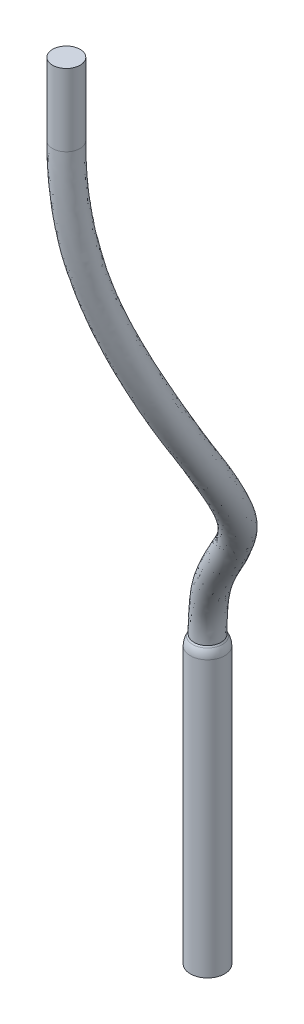
ISO-10303-21;
HEADER;
FILE_DESCRIPTION(('STEP AP214'),'2;1');
FILE_NAME('part.step','',(''),(''),'','','');
FILE_SCHEMA(('AUTOMOTIVE_DESIGN { 1 0 10303 214 1 1 1 1 }'));
ENDSEC;
DATA;
#1=APPLICATION_CONTEXT('core data for automotive mechanical design processes');
#2=APPLICATION_PROTOCOL_DEFINITION('international standard','automotive_design',2000,#1);
#3=PRODUCT_CONTEXT('',#1,'mechanical');
#4=PRODUCT('Part','Part','',(#3));
#5=PRODUCT_RELATED_PRODUCT_CATEGORY('part','',(#4));
#6=PRODUCT_DEFINITION_FORMATION('','',#4);
#7=PRODUCT_DEFINITION_CONTEXT('part definition',#1,'design');
#8=PRODUCT_DEFINITION('design','',#6,#7);
#9=PRODUCT_DEFINITION_SHAPE('','',#8);
#10=(LENGTH_UNIT() NAMED_UNIT(*) SI_UNIT(.MILLI.,.METRE.));
#11=(NAMED_UNIT(*) PLANE_ANGLE_UNIT() SI_UNIT($,.RADIAN.));
#12=(NAMED_UNIT(*) SI_UNIT($,.STERADIAN.) SOLID_ANGLE_UNIT());
#13=UNCERTAINTY_MEASURE_WITH_UNIT(LENGTH_MEASURE(1.E-05),#10,'distance_accuracy_value','');
#14=(GEOMETRIC_REPRESENTATION_CONTEXT(3) GLOBAL_UNCERTAINTY_ASSIGNED_CONTEXT((#13)) GLOBAL_UNIT_ASSIGNED_CONTEXT((#10,
#11,#12)) REPRESENTATION_CONTEXT('',''));
#15=CARTESIAN_POINT('',(0.,0.,0.));
#16=DIRECTION('',(0.,0.,1.));
#17=DIRECTION('',(1.,0.,0.));
#18=AXIS2_PLACEMENT_3D('',#15,#16,#17);
#19=CARTESIAN_POINT('',(4.49999999999998,50.0090387850034,0.));
#20=DIRECTION('',(0.,1.,0.));
#21=DIRECTION('',(0.,0.,1.));
#22=AXIS2_PLACEMENT_3D('',#19,#20,#21);
#23=CYLINDRICAL_SURFACE('',#22,0.8);
#24=CARTESIAN_POINT('',(4.49999999999998,50.0090387850034,0.));
#25=DIRECTION('',(0.,1.,0.));
#26=DIRECTION('',(-0.996178366187526,0.,0.0873422162528052));
#27=AXIS2_PLACEMENT_3D('',#24,#25,#26);
#28=CIRCLE('',#27,0.8);
#29=CARTESIAN_POINT('',(3.70305730704996,50.0090387850034,0.0698737730022461));
#30=VERTEX_POINT('',#29);
#31=EDGE_CURVE('E62',#30,#30,#28,.T.);
#32=ORIENTED_EDGE('',*,*,#31,.T.);
#33=EDGE_LOOP('',(#32));
#34=FACE_BOUND('',#33,.T.);
#35=CARTESIAN_POINT('',(4.49999999999998,54.2,0.));
#36=DIRECTION('',(0.,1.,0.));
#37=DIRECTION('',(-0.996178366187526,0.,0.0873422162528052));
#38=AXIS2_PLACEMENT_3D('',#35,#36,#37);
#39=CIRCLE('',#38,0.8);
#40=CARTESIAN_POINT('',(3.70305730704996,54.2,0.0698737730022454));
#41=VERTEX_POINT('',#40);
#42=EDGE_CURVE('E58',#41,#41,#39,.T.);
#43=ORIENTED_EDGE('',*,*,#42,.F.);
#44=EDGE_LOOP('',(#43));
#45=FACE_BOUND('',#44,.T.);
#46=ADVANCED_FACE('F48',(#34,#45),#23,.T.);
#47=CARTESIAN_POINT('',(4.49999999999998,54.2,0.));
#48=DIRECTION('',(0.,1.,0.));
#49=DIRECTION('',(-0.996178366187526,0.,0.0873422162528052));
#50=AXIS2_PLACEMENT_3D('',#47,#48,#49);
#51=PLANE('',#50);
#52=ORIENTED_EDGE('',*,*,#42,.T.);
#53=EDGE_LOOP('',(#52));
#54=FACE_BOUND('',#53,.T.);
#55=ADVANCED_FACE('F94',(#54),#51,.T.);
#56=CARTESIAN_POINT('',(0.,16.,-11.9));
#57=CARTESIAN_POINT('',(0.,17.2559525780895,-11.9));
#58=CARTESIAN_POINT('',(0.403091505071813,18.540237462846,-11.6465180673945));
#59=CARTESIAN_POINT('',(1.34527480045488,20.0001103930743,-11.1487716159247));
#60=CARTESIAN_POINT('',(2.44033772063946,21.4915796384524,-10.6224148454388));
#61=CARTESIAN_POINT('',(3.89128160234494,23.274101773061,-9.87155910965486));
#62=CARTESIAN_POINT('',(4.76918839809828,25.2728671471405,-8.85655027435403));
#63=CARTESIAN_POINT('',(5.51288266956013,26.9135951770051,-7.96609388104944));
#64=CARTESIAN_POINT('',(6.12283469402856,28.5685408803809,-7.00364186008428));
#65=CARTESIAN_POINT('',(6.30703018377296,30.9553864519574,-5.53343819810053));
#66=CARTESIAN_POINT('',(6.04449212514094,33.0026395485499,-4.58540925009685));
#67=CARTESIAN_POINT('',(5.65095314360939,35.6128892590473,-3.27009401527471));
#68=CARTESIAN_POINT('',(5.2763580036156,37.5720319316853,-2.21377376281104));
#69=CARTESIAN_POINT('',(4.57124836012902,40.8641858866959,-1.09437069577219));
#70=CARTESIAN_POINT('',(3.87814128548877,44.3947296270169,-0.375004454167067));
#71=CARTESIAN_POINT('',(3.70305730704998,47.8772532907759,0.0698737730022464));
#72=CARTESIAN_POINT('',(3.70305730704998,50.0090387850034,0.0698737730022443));
#73=CARTESIAN_POINT('',(1.6,16.,-11.9));
#74=CARTESIAN_POINT('',(1.6,17.4928342115409,-11.9));
#75=CARTESIAN_POINT('',(1.92664484186779,17.9457210380144,-11.9170995935814));
#76=CARTESIAN_POINT('',(2.70267187702544,19.3461527082211,-11.7554255431292));
#77=CARTESIAN_POINT('',(3.67043526419325,20.9790080487905,-11.4956844662064));
#78=CARTESIAN_POINT('',(5.13327649211589,22.7691917687015,-10.8685680861593));
#79=CARTESIAN_POINT('',(6.14923989320474,24.4621674582905,-8.99978854801013));
#80=CARTESIAN_POINT('',(6.95334516997232,26.1617070842887,-7.79308381482387));
#81=CARTESIAN_POINT('',(7.57936409093591,28.0150979657151,-6.69608741352185));
#82=CARTESIAN_POINT('',(7.69366190754986,30.4141054236948,-4.75831942612004));
#83=CARTESIAN_POINT('',(6.90355440849289,32.3652367720016,-3.41150689606212));
#84=CARTESIAN_POINT('',(6.25351998465267,35.0202215067219,-1.84652665618109));
#85=CARTESIAN_POINT('',(6.11933806232663,37.1850238604096,-0.880030565262081));
#86=CARTESIAN_POINT('',(5.18039538256626,40.5256851919734,0.315578914175487));
#87=CARTESIAN_POINT('',(3.86070601612413,43.9672588207809,1.25351095270411));
#88=CARTESIAN_POINT('',(3.84280485305447,47.984330694942,1.66375915890229));
#89=CARTESIAN_POINT('',(3.84280485305447,50.0090387850034,1.66375915890229));
#90=CARTESIAN_POINT('',(1.6,16.,-13.5));
#91=CARTESIAN_POINT('',(1.6,17.4928342115409,-13.5));
#92=CARTESIAN_POINT('',(1.79615342748925,18.4473681006353,-13.4674464397293));
#93=CARTESIAN_POINT('',(2.3738896785235,20.0775290277161,-13.1496647994899));
#94=CARTESIAN_POINT('',(3.17229564707743,21.8301563097118,-12.7526703162113));
#95=CARTESIAN_POINT('',(4.54035619015247,23.7493719802292,-12.0852875518057));
#96=CARTESIAN_POINT('',(6.36376325411812,25.0729053387893,-10.4664781519266));
#97=CARTESIAN_POINT('',(7.43299341954556,26.7496136080821,-9.23848737151542));
#98=CARTESIAN_POINT('',(8.13518375613291,28.7144499854951,-8.00373990270104));
#99=CARTESIAN_POINT('',(8.636644456538,31.0812760442621,-5.97012182435848));
#100=CARTESIAN_POINT('',(8.23325784878149,32.8758217023589,-4.10828531494213));
#101=CARTESIAN_POINT('',(7.77914229747194,35.4804873298386,-2.29394853566503));
#102=CARTESIAN_POINT('',(7.47703773245718,37.7597374880465,-1.56593976156856));
#103=CARTESIAN_POINT('',(6.58724017399727,40.9975411922167,-0.187833124401304));
#104=CARTESIAN_POINT('',(5.52398284373418,44.1290840295959,1.28917381868456));
#105=CARTESIAN_POINT('',(5.43669023895451,47.984330694942,1.5240116128978));
#106=CARTESIAN_POINT('',(5.43669023895451,50.0090387850034,1.5240116128978));
#107=CARTESIAN_POINT('',(0.,16.,-13.5));
#108=CARTESIAN_POINT('',(0.,17.3743933948152,-13.5));
#109=CARTESIAN_POINT('',(0.272600090693276,19.0227033489015,-13.1968649135424));
#110=CARTESIAN_POINT('',(1.01649260195294,20.7133935550734,-12.5430108722853));
#111=CARTESIAN_POINT('',(1.94219810352365,22.3538009071442,-11.8794006954436));
#112=CARTESIAN_POINT('',(3.29836130038153,24.250338591307,-11.0882785753012));
#113=CARTESIAN_POINT('',(4.98371175901166,25.8835572354621,-10.3232398782705));
#114=CARTESIAN_POINT('',(5.99253091913338,27.501984732837,-9.41149743774099));
#115=CARTESIAN_POINT('',(6.67865435922556,29.2676063213015,-8.31129434926348));
#116=CARTESIAN_POINT('',(7.25001273276111,31.6228290426341,-6.74524059633897));
#117=CARTESIAN_POINT('',(7.37419556542955,33.5127764708972,-5.28218766897686));
#118=CARTESIAN_POINT('',(7.17657545642866,36.0741206032284,-3.71751589475865));
#119=CARTESIAN_POINT('',(6.63405767374615,38.1506723019917,-2.89968295911751));
#120=CARTESIAN_POINT('',(5.97809315156002,41.3302280459851,-1.59778273434898));
#121=CARTESIAN_POINT('',(5.54141811309882,44.5392922838883,-0.339341588186614));
#122=CARTESIAN_POINT('',(5.29694269295002,47.9307919928589,-0.069873773002242));
#123=CARTESIAN_POINT('',(5.29694269295002,50.0090387850034,-0.069873773002244));
#124=CARTESIAN_POINT('',(-1.6,16.,-13.5));
#125=CARTESIAN_POINT('',(-1.6,17.2559525780895,-13.5));
#126=CARTESIAN_POINT('',(-1.2509532461027,19.5980385971677,-12.9262833873555));
#127=CARTESIAN_POINT('',(-0.340904474617622,21.3492580824307,-11.9363569450807));
#128=CARTESIAN_POINT('',(0.712100559969858,22.8774455045765,-11.0061310746759));
#129=CARTESIAN_POINT('',(2.05636641061058,24.7513052023847,-10.0912695987967));
#130=CARTESIAN_POINT('',(3.6036602639052,26.6942091321348,-10.1800016046144));
#131=CARTESIAN_POINT('',(4.55206841872119,28.254355857592,-9.58450750396656));
#132=CARTESIAN_POINT('',(5.2221249623182,29.8207626571079,-8.61884879582591));
#133=CARTESIAN_POINT('',(5.86338100898421,32.1643820410061,-7.52035936831946));
#134=CARTESIAN_POINT('',(6.5151332820776,34.1497312394354,-6.45609002301159));
#135=CARTESIAN_POINT('',(6.57400861538538,36.6677538766182,-5.14108325385227));
#136=CARTESIAN_POINT('',(5.79107761503513,38.5416071159369,-4.23342615666647));
#137=CARTESIAN_POINT('',(5.36894612912279,41.6629148997534,-3.00773234429666));
#138=CARTESIAN_POINT('',(5.55885338246346,44.9495005381807,-1.96785699505779));
#139=CARTESIAN_POINT('',(5.15719514694553,47.8772532907759,-1.66375915890228));
#140=CARTESIAN_POINT('',(5.15719514694553,50.0090387850034,-1.66375915890229));
#141=CARTESIAN_POINT('',(-1.6,16.,-11.9));
#142=CARTESIAN_POINT('',(-1.6,17.019070944638,-11.9));
#143=CARTESIAN_POINT('',(-1.12046183172416,19.1347538876777,-11.3759365412076));
#144=CARTESIAN_POINT('',(-0.0121222761156849,20.6540680779275,-10.5421176887201));
#145=CARTESIAN_POINT('',(1.21024017708567,22.0041512281143,-9.7491452246711));
#146=CARTESIAN_POINT('',(2.649286712574,23.7790117774205,-8.8745501331504));
#147=CARTESIAN_POINT('',(3.38913690299183,26.0835668359905,-8.71331200069793));
#148=CARTESIAN_POINT('',(4.07242016914795,27.6654832697215,-8.13910394727501));
#149=CARTESIAN_POINT('',(4.66630529712121,29.1219837950467,-7.31119630664672));
#150=CARTESIAN_POINT('',(4.92039845999606,31.4966674802201,-6.30855697008102));
#151=CARTESIAN_POINT('',(5.18542984178899,33.6400423250983,-5.75931160413158));
#152=CARTESIAN_POINT('',(5.04838630256611,36.2055570113728,-4.69366137436833));
#153=CARTESIAN_POINT('',(4.43337794490458,37.959040002961,-3.54751696035999));
#154=CARTESIAN_POINT('',(3.96210133769178,41.2026865814184,-2.50432030571987));
#155=CARTESIAN_POINT('',(3.89557655485341,44.8222004332528,-2.00351986103824));
#156=CARTESIAN_POINT('',(3.56330976104549,47.7701758866099,-1.5240116128978));
#157=CARTESIAN_POINT('',(3.56330976104549,50.0090387850034,-1.5240116128978));
#158=CARTESIAN_POINT('',(0.,16.,-11.9));
#159=CARTESIAN_POINT('',(0.,17.2559525780895,-11.9));
#160=CARTESIAN_POINT('',(0.403091505071813,18.540237462846,-11.6465180673945));
#161=CARTESIAN_POINT('',(1.34527480045488,20.0001103930743,-11.1487716159247));
#162=CARTESIAN_POINT('',(2.44033772063946,21.4915796384524,-10.6224148454388));
#163=CARTESIAN_POINT('',(3.89128160234494,23.274101773061,-9.87155910965486));
#164=CARTESIAN_POINT('',(4.76918839809828,25.2728671471405,-8.85655027435403));
#165=CARTESIAN_POINT('',(5.51288266956013,26.9135951770051,-7.96609388104944));
#166=CARTESIAN_POINT('',(6.12283469402856,28.5685408803809,-7.00364186008428));
#167=CARTESIAN_POINT('',(6.30703018377296,30.9553864519574,-5.53343819810053));
#168=CARTESIAN_POINT('',(6.04449212514094,33.0026395485499,-4.58540925009685));
#169=CARTESIAN_POINT('',(5.65095314360939,35.6128892590473,-3.27009401527471));
#170=CARTESIAN_POINT('',(5.2763580036156,37.5720319316853,-2.21377376281104));
#171=CARTESIAN_POINT('',(4.57124836012902,40.8641858866959,-1.09437069577219));
#172=CARTESIAN_POINT('',(3.87814128548877,44.3947296270169,-0.375004454167067));
#173=CARTESIAN_POINT('',(3.70305730704998,47.8772532907759,0.0698737730022464));
#174=CARTESIAN_POINT('',(3.70305730704998,50.0090387850034,0.0698737730022443));
#175=(BOUNDED_SURFACE() B_SPLINE_SURFACE(3,3,((#56,#57,#58,#59,#60,#61,#62,#63,#64,#65,#66,#67,
#68,#69,#70,#71,#72),(#73,#74,#75,#76,#77,#78,#79,#80,#81,#82,#83,#84,#85,#86,#87,#88,#89),(#90,
#91,#92,#93,#94,#95,#96,#97,#98,#99,#100,#101,#102,#103,#104,#105,#106),(#107,#108,#109,#110,
#111,#112,#113,#114,#115,#116,#117,#118,#119,#120,#121,#122,#123),(#124,#125,#126,#127,#128,
#129,#130,#131,#132,#133,#134,#135,#136,#137,#138,#139,#140),(#141,#142,#143,#144,#145,#146,
#147,#148,#149,#150,#151,#152,#153,#154,#155,#156,#157),(#158,#159,#160,#161,#162,#163,#164,
#165,#166,#167,#168,#169,#170,#171,#172,#173,#174)),.UNSPECIFIED.,.T.,.F.,
.F.) B_SPLINE_SURFACE_WITH_KNOTS((4,3,4),(4,1,1,1,1,1,1,1,1,1,1,1,1,1,4),(0.,0.5,1.),(0.,
0.0784000000000002,0.124440543770086,0.1568,0.2352,0.3136,0.340451805333765,0.395733333333334,
0.477866666666667,0.56,0.572260640379593,0.706666666666667,0.735194176263332,0.853333333333333,
1.),.UNSPECIFIED.) GEOMETRIC_REPRESENTATION_ITEM() RATIONAL_B_SPLINE_SURFACE(((1.,1.,1.,1.,1.,
1.,1.,1.,1.,1.,1.,1.,1.,1.,1.,1.,1.),(0.333333333333333,0.333333333333333,0.333333333333333,
0.333333333333333,0.333333333333333,0.333333333333333,0.333333333333333,0.333333333333333,
0.333333333333333,0.333333333333333,0.333333333333333,0.333333333333333,0.333333333333333,
0.333333333333333,0.333333333333333,0.333333333333333,0.333333333333333),(0.333333333333333,
0.333333333333333,0.333333333333333,0.333333333333333,0.333333333333333,0.333333333333333,
0.333333333333333,0.333333333333333,0.333333333333333,0.333333333333333,0.333333333333333,
0.333333333333333,0.333333333333333,0.333333333333333,0.333333333333333,0.333333333333333,
0.333333333333333),(1.,1.,1.,1.,1.,1.,1.,1.,1.,1.,1.,1.,1.,1.,1.,1.,1.),(0.333333333333333,
0.333333333333333,0.333333333333333,0.333333333333333,0.333333333333333,0.333333333333333,
0.333333333333333,0.333333333333333,0.333333333333333,0.333333333333333,0.333333333333333,
0.333333333333333,0.333333333333333,0.333333333333333,0.333333333333333,0.333333333333333,
0.333333333333333),(0.333333333333333,0.333333333333333,0.333333333333333,0.333333333333333,
0.333333333333333,0.333333333333333,0.333333333333333,0.333333333333333,0.333333333333333,
0.333333333333333,0.333333333333333,0.333333333333333,0.333333333333333,0.333333333333333,
0.333333333333333,0.333333333333333,0.333333333333333),(1.,1.,1.,1.,1.,1.,1.,1.,1.,1.,1.,1.,1.,
1.,1.,1.,1.))) REPRESENTATION_ITEM('') SURFACE());
#176=CARTESIAN_POINT('',(0.0205605349442315,16.591752911281,-11.8872081742325));
#177=CARTESIAN_POINT('',(-0.02547544912491,16.5928792916268,-11.8866964637301));
#178=CARTESIAN_POINT('',(-0.071592436270296,16.5941818360301,-11.890205114694));
#179=CARTESIAN_POINT('',(-0.162538963789051,16.5971595883087,-11.9052066219062));
#180=CARTESIAN_POINT('',(-0.207366794231292,16.5988352674949,-11.9167096152275));
#181=CARTESIAN_POINT('',(-0.292691358313332,16.6024703578348,-11.9467873558279));
#182=CARTESIAN_POINT('',(-0.333287233944967,16.6044168707182,-11.9650826387193));
#183=CARTESIAN_POINT('',(-0.410807028589949,16.6086019157634,-12.0082387628112));
#184=CARTESIAN_POINT('',(-0.447731078517673,16.6108404375072,-12.0330993698176));
#185=CARTESIAN_POINT('',(-0.516783568821065,16.6155423396371,-12.0886091908317));
#186=CARTESIAN_POINT('',(-0.548922361774014,16.6180052154647,-12.1192455738298));
#187=CARTESIAN_POINT('',(-0.607607452640995,16.6230721150586,-12.1854659312463));
#188=CARTESIAN_POINT('',(-0.634153371742424,16.6256761483707,-12.2210502405232));
#189=CARTESIAN_POINT('',(-0.681000595869749,16.6309203021196,-12.2962695194813));
#190=CARTESIAN_POINT('',(-0.701281899597301,16.6335605105989,-12.3359169358523));
#191=CARTESIAN_POINT('',(-0.734948588284924,16.6387349456357,-12.4180443565465));
#192=CARTESIAN_POINT('',(-0.748333730402983,16.6412691684583,-12.4605244605608));
#193=CARTESIAN_POINT('',(-0.767946444227821,16.6461065405204,-12.5474661050309));
#194=CARTESIAN_POINT('',(-0.774117650103787,16.6484077433977,-12.5919404664463));
#195=CARTESIAN_POINT('',(-0.778975168607034,16.6526137762269,-12.6813144784338));
#196=CARTESIAN_POINT('',(-0.777661130167742,16.6545185875833,-12.7262141488547));
#197=CARTESIAN_POINT('',(-0.767567090293712,16.6578246191304,-12.8155705441723));
#198=CARTESIAN_POINT('',(-0.758724128641081,16.6592214503674,-12.8600203256129));
#199=CARTESIAN_POINT('',(-0.733750625197499,16.6614040490975,-12.9468396181863));
#200=CARTESIAN_POINT('',(-0.717619847973585,16.6621897968472,-12.9892090620648));
#201=CARTESIAN_POINT('',(-0.678436959152693,16.6631191041414,-13.0708537537726));
#202=CARTESIAN_POINT('',(-0.655354958132625,16.6632598469855,-13.1101146957522));
#203=CARTESIAN_POINT('',(-0.602937045117438,16.6629134433878,-13.1842105576808));
#204=CARTESIAN_POINT('',(-0.573601140690589,16.6624262977058,-13.219045482986));
#205=CARTESIAN_POINT('',(-0.509550559320314,16.6608960695481,-13.2832173946743));
#206=CARTESIAN_POINT('',(-0.474845857189165,16.659854009465,-13.3125643583354));
#207=CARTESIAN_POINT('',(-0.40099063823381,16.6573179233394,-13.3649720388003));
#208=CARTESIAN_POINT('',(-0.36184028903176,16.6558239143339,-13.3880329925052));
#209=CARTESIAN_POINT('',(-0.280473054792571,16.6525138034821,-13.4270461342295));
#210=CARTESIAN_POINT('',(-0.238277923417526,16.6506998743145,-13.44304387286));
#211=CARTESIAN_POINT('',(-0.151797052806024,16.6468580969652,-13.4676642897169));
#212=CARTESIAN_POINT('',(-0.107511398702387,16.6448302574905,-13.4762872679945));
#213=CARTESIAN_POINT('',(-0.0184540163057428,16.6406825672535,-13.4858521933105));
#214=CARTESIAN_POINT('',(0.0263117396476112,16.6385635031021,-13.4868501783979));
#215=CARTESIAN_POINT('',(0.115369317129818,16.6342729008831,-13.4812910475852));
#216=CARTESIAN_POINT('',(0.15966114414713,16.632101363424,-13.4747340192737));
#217=CARTESIAN_POINT('',(0.246371627485313,16.6278051758798,-13.4542661326457));
#218=CARTESIAN_POINT('',(0.288795575071098,16.6256804031964,-13.4403777189391));
#219=CARTESIAN_POINT('',(0.370702107066139,16.6215338142554,-13.4056533994897));
#220=CARTESIAN_POINT('',(0.410184770367518,16.6195119952367,-13.3848176801719));
#221=CARTESIAN_POINT('',(0.485017643626791,16.6156185348612,-13.336840510508));
#222=CARTESIAN_POINT('',(0.520375258423438,16.6137466263569,-13.3097106288979));
#223=CARTESIAN_POINT('',(0.586046345768496,16.6101746581645,-13.2499023433006));
#224=CARTESIAN_POINT('',(0.61635974840324,16.6084746008585,-13.2172238624215));
#225=CARTESIAN_POINT('',(0.671150398435101,16.6052558628127,-13.147184560113));
#226=CARTESIAN_POINT('',(0.695616234526134,16.6037375395551,-13.1098147970023));
#227=CARTESIAN_POINT('',(0.737961476609704,16.6008892061844,-13.0315075505749));
#228=CARTESIAN_POINT('',(0.755840767633633,16.5995591993586,-12.9905700049977));
#229=CARTESIAN_POINT('',(0.784596463772789,16.5970787408621,-12.9060849308879));
#230=CARTESIAN_POINT('',(0.795439526525597,16.595929163387,-12.8625260292446));
#231=CARTESIAN_POINT('',(0.809701643757817,16.5938111353701,-12.7742052240377));
#232=CARTESIAN_POINT('',(0.813120468624917,16.592842690431,-12.7294432833107));
#233=CARTESIAN_POINT('',(0.812452706955505,16.5910758848937,-12.6397329660553));
#234=CARTESIAN_POINT('',(0.808325979716272,16.5902784593079,-12.5947848689945));
#235=CARTESIAN_POINT('',(0.792618264007528,16.5888557720253,-12.5062077340402));
#236=CARTESIAN_POINT('',(0.781037075383689,16.588230514952,-12.4625787315978));
#237=CARTESIAN_POINT('',(0.750689804177966,16.5871492058033,-12.3776837916838));
#238=CARTESIAN_POINT('',(0.731893454775474,16.5866938826704,-12.3364286622229));
#239=CARTESIAN_POINT('',(0.687655216350399,16.5859608181637,-12.2576503011921));
#240=CARTESIAN_POINT('',(0.662213506124705,16.5856830720129,-12.2201269692538));
#241=CARTESIAN_POINT('',(0.605349227075774,16.585315548864,-12.1498078261833));
#242=CARTESIAN_POINT('',(0.573915688220367,16.5852261203194,-12.1170208832033));
#243=CARTESIAN_POINT('',(0.50598518198734,16.5852534533776,-12.0571966218793));
#244=CARTESIAN_POINT('',(0.469488416676023,16.5853702067543,-12.0301590741941));
#245=CARTESIAN_POINT('',(0.392495956031121,16.5858326327962,-11.9826324342121));
#246=CARTESIAN_POINT('',(0.352003098282503,16.586178144004,-11.9621387383719));
#247=CARTESIAN_POINT('',(0.268178837412102,16.5871245518775,-11.9282983249255));
#248=CARTESIAN_POINT('',(0.22485132406214,16.5877251045398,-11.9149420348936));
#249=CARTESIAN_POINT('',(0.154436066789043,16.5889105636768,-11.8996246223738));
#250=CARTESIAN_POINT('',(0.127850631138237,16.5894039858893,-11.895240090922));
#251=CARTESIAN_POINT('',(0.0743728910764265,16.5904958241013,-11.8891813725647));
#252=CARTESIAN_POINT('',(0.0474805623047623,16.5910942484906,-11.8875074023473));
#253=CARTESIAN_POINT('',(0.0205605349442315,16.591752911281,-11.8872081742325));
#254=B_SPLINE_CURVE_WITH_KNOTS('',3,(#176,#177,#178,#179,#180,#181,#182,#183,#184,#185,#186,
#187,#188,#189,#190,#191,#192,#193,#194,#195,#196,#197,#198,#199,#200,#201,#202,#203,#204,#205,
#206,#207,#208,#209,#210,#211,#212,#213,#214,#215,#216,#217,#218,#219,#220,#221,#222,#223,#224,
#225,#226,#227,#228,#229,#230,#231,#232,#233,#234,#235,#236,#237,#238,#239,#240,#241,#242,#243,
#244,#245,#246,#247,#248,#249,#250,#251,#252,#253),.UNSPECIFIED.,.T.,.F.,(4,2,2,2,2,2,2,2,2,2,2,
2,2,2,2,2,2,2,2,2,2,2,2,2,2,2,2,2,2,2,2,2,2,2,2,2,2,2,4),(0.,0.138052452283573,
0.276280279502807,0.409357717969941,0.542430410024105,0.675210889328242,0.808000359137407,
0.941209510785237,1.0744233529507,1.20867124314799,1.34292542977765,1.47831346290245,
1.61370587005193,1.74968896837509,1.88567190213686,2.02140515889786,2.15713329956415,
2.29197286820026,2.42680695046389,2.56064914005174,2.69448977796333,2.82792302679557,
2.96135269534644,3.09453903495989,3.22772722040568,3.36117323339106,3.49462157557564,
3.62869775480412,3.76277808060004,3.89757376094394,4.03237306073972,4.16774412017692,
4.30311153776047,4.43872921301652,4.57434147751649,4.70985812869058,4.84519257085677,
4.92591374606478,5.00664137398038),.UNSPECIFIED.);
#255=CARTESIAN_POINT('',(0.0205605349442315,16.591752911281,-11.8872081742325));
#256=VERTEX_POINT('',#255);
#257=EDGE_CURVE('E11',#256,#256,#254,.T.);
#258=ORIENTED_EDGE('',*,*,#257,.F.);
#259=EDGE_LOOP('',(#258));
#260=FACE_BOUND('',#259,.T.);
#261=ORIENTED_EDGE('',*,*,#31,.F.);
#262=EDGE_LOOP('',(#261));
#263=FACE_BOUND('',#262,.T.);
#264=ADVANCED_FACE('F90',(#260,#263),#175,.T.);
#265=CARTESIAN_POINT('',(0.,25.0902270310392,-12.7));
#266=DIRECTION('',(0.,1.,0.));
#267=DIRECTION('',(0.,0.,1.));
#268=AXIS2_PLACEMENT_3D('',#265,#266,#267);
#269=CYLINDRICAL_SURFACE('',#268,1.);
#270=CARTESIAN_POINT('',(0.,0.,-12.7));
#271=DIRECTION('',(0.,1.,0.));
#272=DIRECTION('',(0.,0.,1.));
#273=AXIS2_PLACEMENT_3D('',#270,#271,#272);
#274=CIRCLE('',#273,1.);
#275=CARTESIAN_POINT('',(0.,0.,-11.7));
#276=VERTEX_POINT('',#275);
#277=EDGE_CURVE('E66',#276,#276,#274,.T.);
#278=ORIENTED_EDGE('',*,*,#277,.T.);
#279=EDGE_LOOP('',(#278));
#280=FACE_BOUND('',#279,.T.);
#281=CARTESIAN_POINT('',(0.,16.,-12.7));
#282=DIRECTION('',(0.,1.,0.));
#283=DIRECTION('',(0.,0.,1.));
#284=AXIS2_PLACEMENT_3D('',#281,#282,#283);
#285=CIRCLE('',#284,0.999999999999999);
#286=CARTESIAN_POINT('',(0.,16.,-11.7));
#287=VERTEX_POINT('',#286);
#288=EDGE_CURVE('E71',#287,#287,#285,.T.);
#289=ORIENTED_EDGE('',*,*,#288,.F.);
#290=EDGE_LOOP('',(#289));
#291=FACE_BOUND('',#290,.T.);
#292=ADVANCED_FACE('F82',(#280,#291),#269,.T.);
#293=CARTESIAN_POINT('',(0.,16.,-12.7));
#294=DIRECTION('',(0.,1.,0.));
#295=DIRECTION('',(0.,0.,1.));
#296=AXIS2_PLACEMENT_3D('',#293,#294,#295);
#297=SPHERICAL_SURFACE('',#296,1.);
#298=ORIENTED_EDGE('',*,*,#288,.T.);
#299=EDGE_LOOP('',(#298));
#300=FACE_BOUND('',#299,.T.);
#301=CARTESIAN_POINT('',(0.,16.5,-12.7));
#302=DIRECTION('',(0.,1.,0.));
#303=DIRECTION('',(0.,0.,1.));
#304=AXIS2_PLACEMENT_3D('',#301,#302,#303);
#305=CIRCLE('',#304,0.866025403784441);
#306=CARTESIAN_POINT('',(0.,16.5,-11.8339745962156));
#307=VERTEX_POINT('',#306);
#308=EDGE_CURVE('E74',#307,#307,#305,.T.);
#309=ORIENTED_EDGE('',*,*,#308,.F.);
#310=EDGE_LOOP('',(#309));
#311=FACE_BOUND('',#310,.T.);
#312=ADVANCED_FACE('F80',(#300,#311),#297,.T.);
#313=CARTESIAN_POINT('',(0.,18.,-12.7));
#314=DIRECTION('',(0.,-1.,0.));
#315=DIRECTION('',(0.,0.,-1.));
#316=AXIS2_PLACEMENT_3D('',#313,#314,#315);
#317=CONICAL_SURFACE('',#316,0.,0.523598775598293);
#318=ORIENTED_EDGE('',*,*,#257,.T.);
#319=EDGE_LOOP('',(#318));
#320=FACE_BOUND('',#319,.T.);
#321=ORIENTED_EDGE('',*,*,#308,.T.);
#322=EDGE_LOOP('',(#321));
#323=FACE_BOUND('',#322,.T.);
#324=ADVANCED_FACE('F78',(#320,#323),#317,.T.);
#325=CARTESIAN_POINT('',(0.,0.,-12.7));
#326=DIRECTION('',(0.,1.,0.));
#327=DIRECTION('',(0.,0.,1.));
#328=AXIS2_PLACEMENT_3D('',#325,#326,#327);
#329=PLANE('',#328);
#330=ORIENTED_EDGE('',*,*,#277,.F.);
#331=EDGE_LOOP('',(#330));
#332=FACE_BOUND('',#331,.T.);
#333=ADVANCED_FACE('F89',(#332),#329,.F.);
#334=CLOSED_SHELL('',(#46,#55,#264,#292,#312,#324,#333));
#335=MANIFOLD_SOLID_BREP('B2',#334);
#336=ADVANCED_BREP_SHAPE_REPRESENTATION('',(#18,#335),#14);
#337=SHAPE_DEFINITION_REPRESENTATION(#9,#336);
ENDSEC;
END-ISO-10303-21;
